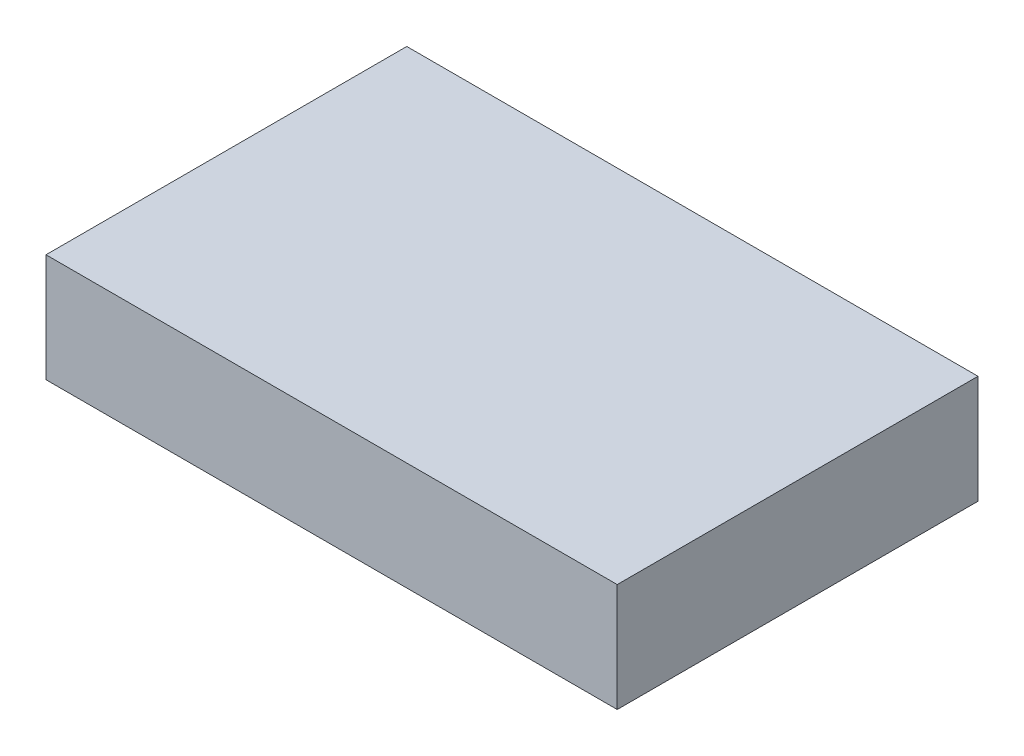
ISO-10303-21;
HEADER;
FILE_DESCRIPTION(('STEP AP214'),'2;1');
FILE_NAME('part.step','',(''),(''),'','','');
FILE_SCHEMA(('AUTOMOTIVE_DESIGN { 1 0 10303 214 1 1 1 1 }'));
ENDSEC;
DATA;
#1=APPLICATION_CONTEXT('core data for automotive mechanical design processes');
#2=APPLICATION_PROTOCOL_DEFINITION('international standard','automotive_design',2000,#1);
#3=PRODUCT_CONTEXT('',#1,'mechanical');
#4=PRODUCT('Part','Part','',(#3));
#5=PRODUCT_RELATED_PRODUCT_CATEGORY('part','',(#4));
#6=PRODUCT_DEFINITION_FORMATION('','',#4);
#7=PRODUCT_DEFINITION_CONTEXT('part definition',#1,'design');
#8=PRODUCT_DEFINITION('design','',#6,#7);
#9=PRODUCT_DEFINITION_SHAPE('','',#8);
#10=(LENGTH_UNIT() NAMED_UNIT(*) SI_UNIT(.MILLI.,.METRE.));
#11=(NAMED_UNIT(*) PLANE_ANGLE_UNIT() SI_UNIT($,.RADIAN.));
#12=(NAMED_UNIT(*) SI_UNIT($,.STERADIAN.) SOLID_ANGLE_UNIT());
#13=UNCERTAINTY_MEASURE_WITH_UNIT(LENGTH_MEASURE(1.E-05),#10,'distance_accuracy_value','');
#14=(GEOMETRIC_REPRESENTATION_CONTEXT(3) GLOBAL_UNCERTAINTY_ASSIGNED_CONTEXT((#13)) GLOBAL_UNIT_ASSIGNED_CONTEXT((#10,
#11,#12)) REPRESENTATION_CONTEXT('',''));
#15=CARTESIAN_POINT('',(0.,0.,0.));
#16=DIRECTION('',(0.,0.,1.));
#17=DIRECTION('',(1.,0.,0.));
#18=AXIS2_PLACEMENT_3D('',#15,#16,#17);
#19=CARTESIAN_POINT('',(-52.1912913327659,18.,-35.0160959707077));
#20=DIRECTION('',(1.,0.,0.));
#21=DIRECTION('',(0.,0.,-1.));
#22=AXIS2_PLACEMENT_3D('',#19,#20,#21);
#23=PLANE('',#22);
#24=DIRECTION('',(0.,0.,1.));
#25=VECTOR('',#24,1.);
#26=CARTESIAN_POINT('',(-52.1912913327659,0.,-35.0160959707077));
#27=LINE('',#26,#25);
#28=CARTESIAN_POINT('',(-52.1912913327659,0.,-35.0160959707077));
#29=VERTEX_POINT('',#28);
#30=CARTESIAN_POINT('',(-52.1912913327659,0.,24.9839040292923));
#31=VERTEX_POINT('',#30);
#32=EDGE_CURVE('E96',#29,#31,#27,.T.);
#33=ORIENTED_EDGE('',*,*,#32,.T.);
#34=DIRECTION('',(0.,-1.,0.));
#35=VECTOR('',#34,1.);
#36=CARTESIAN_POINT('',(-52.1912913327659,18.,24.9839040292923));
#37=LINE('',#36,#35);
#38=CARTESIAN_POINT('',(-52.1912913327659,18.,24.9839040292923));
#39=VERTEX_POINT('',#38);
#40=EDGE_CURVE('E11',#39,#31,#37,.T.);
#41=ORIENTED_EDGE('',*,*,#40,.F.);
#42=DIRECTION('',(0.,0.,1.));
#43=VECTOR('',#42,1.);
#44=CARTESIAN_POINT('',(-52.1912913327659,18.,-35.0160959707077));
#45=LINE('',#44,#43);
#46=CARTESIAN_POINT('',(-52.1912913327659,18.,-35.0160959707077));
#47=VERTEX_POINT('',#46);
#48=EDGE_CURVE('E84',#47,#39,#45,.T.);
#49=ORIENTED_EDGE('',*,*,#48,.F.);
#50=DIRECTION('',(0.,-1.,0.));
#51=VECTOR('',#50,1.);
#52=CARTESIAN_POINT('',(-52.1912913327659,18.,-35.0160959707077));
#53=LINE('',#52,#51);
#54=EDGE_CURVE('E92',#47,#29,#53,.T.);
#55=ORIENTED_EDGE('',*,*,#54,.T.);
#56=EDGE_LOOP('',(#33,#41,#49,#55));
#57=FACE_BOUND('',#56,.T.);
#58=ADVANCED_FACE('F33',(#57),#23,.F.);
#59=CARTESIAN_POINT('',(-52.1912913327659,18.,24.9839040292923));
#60=DIRECTION('',(0.,0.,-1.));
#61=DIRECTION('',(-1.,0.,0.));
#62=AXIS2_PLACEMENT_3D('',#59,#60,#61);
#63=PLANE('',#62);
#64=DIRECTION('',(1.,0.,0.));
#65=VECTOR('',#64,1.);
#66=CARTESIAN_POINT('',(-52.1912913327659,0.,24.9839040292923));
#67=LINE('',#66,#65);
#68=CARTESIAN_POINT('',(42.8087086672341,0.,24.9839040292922));
#69=VERTEX_POINT('',#68);
#70=EDGE_CURVE('E88',#31,#69,#67,.T.);
#71=ORIENTED_EDGE('',*,*,#70,.T.);
#72=DIRECTION('',(0.,-1.,0.));
#73=VECTOR('',#72,1.);
#74=CARTESIAN_POINT('',(42.8087086672341,18.,24.9839040292922));
#75=LINE('',#74,#73);
#76=CARTESIAN_POINT('',(42.8087086672341,18.,24.9839040292922));
#77=VERTEX_POINT('',#76);
#78=EDGE_CURVE('E41',#77,#69,#75,.T.);
#79=ORIENTED_EDGE('',*,*,#78,.F.);
#80=DIRECTION('',(1.,0.,0.));
#81=VECTOR('',#80,1.);
#82=CARTESIAN_POINT('',(-52.1912913327659,18.,24.9839040292923));
#83=LINE('',#82,#81);
#84=EDGE_CURVE('E79',#39,#77,#83,.T.);
#85=ORIENTED_EDGE('',*,*,#84,.F.);
#86=ORIENTED_EDGE('',*,*,#40,.T.);
#87=EDGE_LOOP('',(#71,#79,#85,#86));
#88=FACE_BOUND('',#87,.T.);
#89=ADVANCED_FACE('F87',(#88),#63,.F.);
#90=CARTESIAN_POINT('',(42.8087086672341,18.,-35.0160959707078));
#91=DIRECTION('',(-1.,0.,0.));
#92=DIRECTION('',(0.,0.,1.));
#93=AXIS2_PLACEMENT_3D('',#90,#91,#92);
#94=PLANE('',#93);
#95=DIRECTION('',(0.,0.,-1.));
#96=VECTOR('',#95,1.);
#97=CARTESIAN_POINT('',(42.8087086672341,0.,-35.0160959707078));
#98=LINE('',#97,#96);
#99=CARTESIAN_POINT('',(42.8087086672341,0.,-35.0160959707078));
#100=VERTEX_POINT('',#99);
#101=EDGE_CURVE('E66',#69,#100,#98,.T.);
#102=ORIENTED_EDGE('',*,*,#101,.T.);
#103=DIRECTION('',(0.,-1.,0.));
#104=VECTOR('',#103,1.);
#105=CARTESIAN_POINT('',(42.8087086672341,18.,-35.0160959707078));
#106=LINE('',#105,#104);
#107=CARTESIAN_POINT('',(42.8087086672341,18.,-35.0160959707078));
#108=VERTEX_POINT('',#107);
#109=EDGE_CURVE('E89',#108,#100,#106,.T.);
#110=ORIENTED_EDGE('',*,*,#109,.F.);
#111=DIRECTION('',(0.,0.,-1.));
#112=VECTOR('',#111,1.);
#113=CARTESIAN_POINT('',(42.8087086672341,18.,-35.0160959707078));
#114=LINE('',#113,#112);
#115=EDGE_CURVE('E82',#77,#108,#114,.T.);
#116=ORIENTED_EDGE('',*,*,#115,.F.);
#117=ORIENTED_EDGE('',*,*,#78,.T.);
#118=EDGE_LOOP('',(#102,#110,#116,#117));
#119=FACE_BOUND('',#118,.T.);
#120=ADVANCED_FACE('F90',(#119),#94,.F.);
#121=CARTESIAN_POINT('',(-52.1912913327659,18.,-35.0160959707077));
#122=DIRECTION('',(0.,0.,1.));
#123=DIRECTION('',(1.,0.,0.));
#124=AXIS2_PLACEMENT_3D('',#121,#122,#123);
#125=PLANE('',#124);
#126=DIRECTION('',(-1.,0.,0.));
#127=VECTOR('',#126,1.);
#128=CARTESIAN_POINT('',(-52.1912913327659,0.,-35.0160959707077));
#129=LINE('',#128,#127);
#130=EDGE_CURVE('E72',#100,#29,#129,.T.);
#131=ORIENTED_EDGE('',*,*,#130,.T.);
#132=ORIENTED_EDGE('',*,*,#54,.F.);
#133=DIRECTION('',(-1.,0.,0.));
#134=VECTOR('',#133,1.);
#135=CARTESIAN_POINT('',(-52.1912913327659,18.,-35.0160959707077));
#136=LINE('',#135,#134);
#137=EDGE_CURVE('E49',#108,#47,#136,.T.);
#138=ORIENTED_EDGE('',*,*,#137,.F.);
#139=ORIENTED_EDGE('',*,*,#109,.T.);
#140=EDGE_LOOP('',(#131,#132,#138,#139));
#141=FACE_BOUND('',#140,.T.);
#142=ADVANCED_FACE('F103',(#141),#125,.F.);
#143=CARTESIAN_POINT('',(0.,18.,0.));
#144=DIRECTION('',(0.,1.,0.));
#145=DIRECTION('',(0.,0.,1.));
#146=AXIS2_PLACEMENT_3D('',#143,#144,#145);
#147=PLANE('',#146);
#148=ORIENTED_EDGE('',*,*,#48,.T.);
#149=ORIENTED_EDGE('',*,*,#84,.T.);
#150=ORIENTED_EDGE('',*,*,#115,.T.);
#151=ORIENTED_EDGE('',*,*,#137,.T.);
#152=EDGE_LOOP('',(#148,#149,#150,#151));
#153=FACE_BOUND('',#152,.T.);
#154=ADVANCED_FACE('F80',(#153),#147,.T.);
#155=CARTESIAN_POINT('',(0.,0.,0.));
#156=DIRECTION('',(0.,1.,0.));
#157=DIRECTION('',(0.,0.,1.));
#158=AXIS2_PLACEMENT_3D('',#155,#156,#157);
#159=PLANE('',#158);
#160=ORIENTED_EDGE('',*,*,#32,.F.);
#161=ORIENTED_EDGE('',*,*,#130,.F.);
#162=ORIENTED_EDGE('',*,*,#101,.F.);
#163=ORIENTED_EDGE('',*,*,#70,.F.);
#164=EDGE_LOOP('',(#160,#161,#162,#163));
#165=FACE_BOUND('',#164,.T.);
#166=ADVANCED_FACE('F106',(#165),#159,.F.);
#167=CLOSED_SHELL('',(#58,#89,#120,#142,#154,#166));
#168=MANIFOLD_SOLID_BREP('B2',#167);
#169=ADVANCED_BREP_SHAPE_REPRESENTATION('',(#18,#168),#14);
#170=SHAPE_DEFINITION_REPRESENTATION(#9,#169);
ENDSEC;
END-ISO-10303-21;
